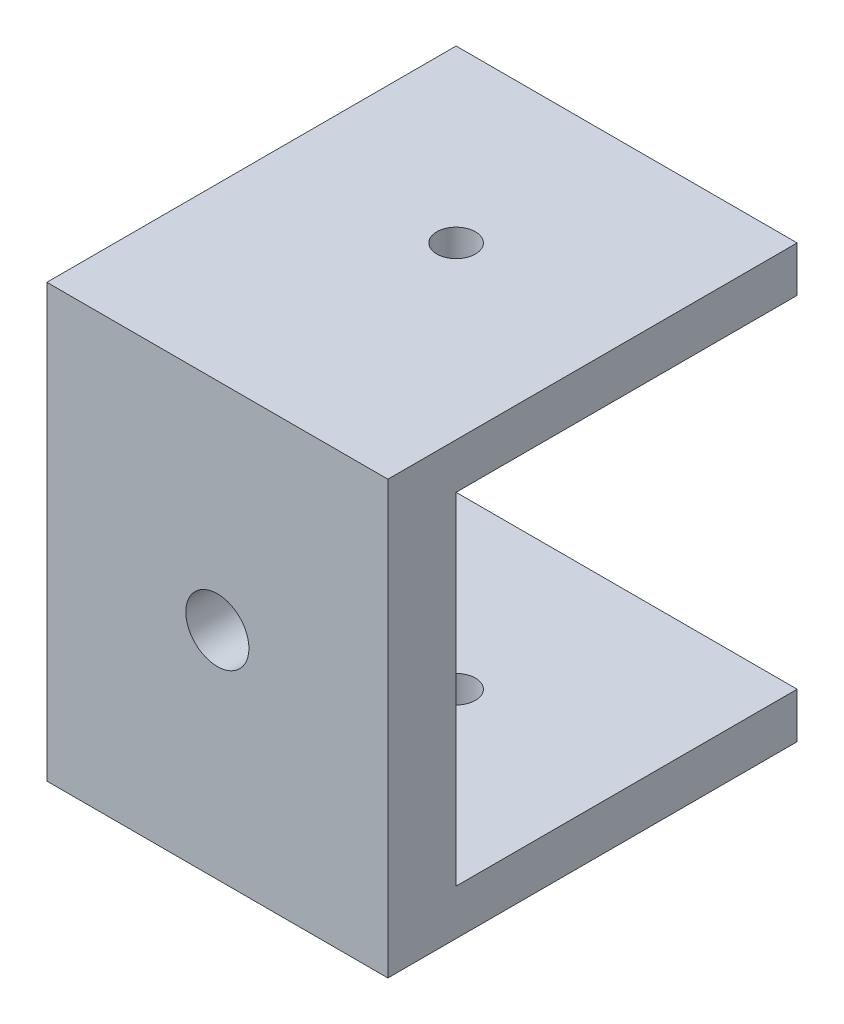
ISO-10303-21;
HEADER;
FILE_DESCRIPTION(('STEP AP214'),'2;1');
FILE_NAME('part.step','',(''),(''),'','','');
FILE_SCHEMA(('AUTOMOTIVE_DESIGN { 1 0 10303 214 1 1 1 1 }'));
ENDSEC;
DATA;
#1=APPLICATION_CONTEXT('core data for automotive mechanical design processes');
#2=APPLICATION_PROTOCOL_DEFINITION('international standard','automotive_design',2000,#1);
#3=PRODUCT_CONTEXT('',#1,'mechanical');
#4=PRODUCT('Part','Part','',(#3));
#5=PRODUCT_RELATED_PRODUCT_CATEGORY('part','',(#4));
#6=PRODUCT_DEFINITION_FORMATION('','',#4);
#7=PRODUCT_DEFINITION_CONTEXT('part definition',#1,'design');
#8=PRODUCT_DEFINITION('design','',#6,#7);
#9=PRODUCT_DEFINITION_SHAPE('','',#8);
#10=(LENGTH_UNIT() NAMED_UNIT(*) SI_UNIT(.MILLI.,.METRE.));
#11=(NAMED_UNIT(*) PLANE_ANGLE_UNIT() SI_UNIT($,.RADIAN.));
#12=(NAMED_UNIT(*) SI_UNIT($,.STERADIAN.) SOLID_ANGLE_UNIT());
#13=UNCERTAINTY_MEASURE_WITH_UNIT(LENGTH_MEASURE(1.E-05),#10,'distance_accuracy_value','');
#14=(GEOMETRIC_REPRESENTATION_CONTEXT(3) GLOBAL_UNCERTAINTY_ASSIGNED_CONTEXT((#13)) GLOBAL_UNIT_ASSIGNED_CONTEXT((#10,
#11,#12)) REPRESENTATION_CONTEXT('',''));
#15=CARTESIAN_POINT('',(0.,0.,0.));
#16=DIRECTION('',(0.,0.,1.));
#17=DIRECTION('',(1.,0.,0.));
#18=AXIS2_PLACEMENT_3D('',#15,#16,#17);
#19=CARTESIAN_POINT('',(30.,0.,-3.));
#20=DIRECTION('',(0.,0.,-1.));
#21=DIRECTION('',(0.,1.,0.));
#22=AXIS2_PLACEMENT_3D('',#19,#20,#21);
#23=PLANE('',#22);
#24=CARTESIAN_POINT('',(15.,0.,-3.));
#25=DIRECTION('',(0.,0.,-1.));
#26=DIRECTION('',(0.,1.,0.));
#27=AXIS2_PLACEMENT_3D('',#24,#25,#26);
#28=CIRCLE('',#27,2.775);
#29=CARTESIAN_POINT('',(15.,2.775,-3.));
#30=VERTEX_POINT('',#29);
#31=EDGE_CURVE('E138',#30,#30,#28,.T.);
#32=ORIENTED_EDGE('',*,*,#31,.F.);
#33=EDGE_LOOP('',(#32));
#34=FACE_BOUND('',#33,.T.);
#35=DIRECTION('',(0.,-1.,0.));
#36=VECTOR('',#35,1.);
#37=CARTESIAN_POINT('',(0.,0.,-3.));
#38=LINE('',#37,#36);
#39=CARTESIAN_POINT('',(0.,15.,-3.));
#40=VERTEX_POINT('',#39);
#41=CARTESIAN_POINT('',(0.,-15.,-3.));
#42=VERTEX_POINT('',#41);
#43=EDGE_CURVE('E135',#40,#42,#38,.T.);
#44=ORIENTED_EDGE('',*,*,#43,.F.);
#45=DIRECTION('',(-1.,0.,0.));
#46=VECTOR('',#45,1.);
#47=CARTESIAN_POINT('',(30.,15.,-3.));
#48=LINE('',#47,#46);
#49=CARTESIAN_POINT('',(30.,15.,-3.));
#50=VERTEX_POINT('',#49);
#51=EDGE_CURVE('E11',#50,#40,#48,.T.);
#52=ORIENTED_EDGE('',*,*,#51,.F.);
#53=DIRECTION('',(0.,-1.,0.));
#54=VECTOR('',#53,1.);
#55=CARTESIAN_POINT('',(30.,0.,-3.));
#56=LINE('',#55,#54);
#57=CARTESIAN_POINT('',(30.,-15.,-3.));
#58=VERTEX_POINT('',#57);
#59=EDGE_CURVE('E154',#50,#58,#56,.T.);
#60=ORIENTED_EDGE('',*,*,#59,.T.);
#61=DIRECTION('',(-1.,0.,0.));
#62=VECTOR('',#61,1.);
#63=CARTESIAN_POINT('',(30.,-15.,-3.));
#64=LINE('',#63,#62);
#65=EDGE_CURVE('E56',#58,#42,#64,.T.);
#66=ORIENTED_EDGE('',*,*,#65,.T.);
#67=EDGE_LOOP('',(#44,#52,#60,#66));
#68=FACE_BOUND('',#67,.T.);
#69=ADVANCED_FACE('F39',(#34,#68),#23,.T.);
#70=CARTESIAN_POINT('',(30.,15.,0.));
#71=DIRECTION('',(0.,1.,0.));
#72=DIRECTION('',(0.,0.,1.));
#73=AXIS2_PLACEMENT_3D('',#70,#71,#72);
#74=PLANE('',#73);
#75=CARTESIAN_POINT('',(15.,15.,-18.));
#76=DIRECTION('',(0.,1.,0.));
#77=DIRECTION('',(0.,0.,1.));
#78=AXIS2_PLACEMENT_3D('',#75,#76,#77);
#79=CIRCLE('',#78,1.7);
#80=CARTESIAN_POINT('',(15.,15.,-16.3));
#81=VERTEX_POINT('',#80);
#82=EDGE_CURVE('E191',#81,#81,#79,.T.);
#83=ORIENTED_EDGE('',*,*,#82,.T.);
#84=EDGE_LOOP('',(#83));
#85=FACE_BOUND('',#84,.T.);
#86=DIRECTION('',(0.,0.,-1.));
#87=VECTOR('',#86,1.);
#88=CARTESIAN_POINT('',(0.,15.,0.));
#89=LINE('',#88,#87);
#90=CARTESIAN_POINT('',(0.,15.,-33.));
#91=VERTEX_POINT('',#90);
#92=EDGE_CURVE('E137',#40,#91,#89,.T.);
#93=ORIENTED_EDGE('',*,*,#92,.T.);
#94=DIRECTION('',(-1.,0.,0.));
#95=VECTOR('',#94,1.);
#96=CARTESIAN_POINT('',(30.,15.,-33.));
#97=LINE('',#96,#95);
#98=CARTESIAN_POINT('',(30.,15.,-33.));
#99=VERTEX_POINT('',#98);
#100=EDGE_CURVE('E48',#99,#91,#97,.T.);
#101=ORIENTED_EDGE('',*,*,#100,.F.);
#102=DIRECTION('',(0.,0.,-1.));
#103=VECTOR('',#102,1.);
#104=CARTESIAN_POINT('',(30.,15.,0.));
#105=LINE('',#104,#103);
#106=EDGE_CURVE('E181',#50,#99,#105,.T.);
#107=ORIENTED_EDGE('',*,*,#106,.F.);
#108=ORIENTED_EDGE('',*,*,#51,.T.);
#109=EDGE_LOOP('',(#93,#101,#107,#108));
#110=FACE_BOUND('',#109,.T.);
#111=ADVANCED_FACE('F211',(#85,#110),#74,.F.);
#112=CARTESIAN_POINT('',(30.,0.,-33.));
#113=DIRECTION('',(0.,0.,1.));
#114=DIRECTION('',(1.,0.,0.));
#115=AXIS2_PLACEMENT_3D('',#112,#113,#114);
#116=PLANE('',#115);
#117=DIRECTION('',(0.,1.,0.));
#118=VECTOR('',#117,1.);
#119=CARTESIAN_POINT('',(0.,0.,-33.));
#120=LINE('',#119,#118);
#121=CARTESIAN_POINT('',(0.,19.,-33.));
#122=VERTEX_POINT('',#121);
#123=EDGE_CURVE('E140',#91,#122,#120,.T.);
#124=ORIENTED_EDGE('',*,*,#123,.T.);
#125=DIRECTION('',(-1.,0.,0.));
#126=VECTOR('',#125,1.);
#127=CARTESIAN_POINT('',(30.,19.,-33.));
#128=LINE('',#127,#126);
#129=CARTESIAN_POINT('',(30.,19.,-33.));
#130=VERTEX_POINT('',#129);
#131=EDGE_CURVE('E160',#130,#122,#128,.T.);
#132=ORIENTED_EDGE('',*,*,#131,.F.);
#133=DIRECTION('',(0.,1.,0.));
#134=VECTOR('',#133,1.);
#135=CARTESIAN_POINT('',(30.,0.,-33.));
#136=LINE('',#135,#134);
#137=EDGE_CURVE('E169',#99,#130,#136,.T.);
#138=ORIENTED_EDGE('',*,*,#137,.F.);
#139=ORIENTED_EDGE('',*,*,#100,.T.);
#140=EDGE_LOOP('',(#124,#132,#138,#139));
#141=FACE_BOUND('',#140,.T.);
#142=ADVANCED_FACE('F167',(#141),#116,.F.);
#143=CARTESIAN_POINT('',(30.,19.,0.));
#144=DIRECTION('',(0.,1.,0.));
#145=DIRECTION('',(0.,0.,1.));
#146=AXIS2_PLACEMENT_3D('',#143,#144,#145);
#147=PLANE('',#146);
#148=CARTESIAN_POINT('',(15.,19.,-18.));
#149=DIRECTION('',(0.,-1.,0.));
#150=DIRECTION('',(0.,0.,-1.));
#151=AXIS2_PLACEMENT_3D('',#148,#149,#150);
#152=CIRCLE('',#151,1.7);
#153=CARTESIAN_POINT('',(15.,19.,-19.7));
#154=VERTEX_POINT('',#153);
#155=EDGE_CURVE('E197',#154,#154,#152,.T.);
#156=ORIENTED_EDGE('',*,*,#155,.T.);
#157=EDGE_LOOP('',(#156));
#158=FACE_BOUND('',#157,.T.);
#159=DIRECTION('',(0.,0.,-1.));
#160=VECTOR('',#159,1.);
#161=CARTESIAN_POINT('',(0.,19.,0.));
#162=LINE('',#161,#160);
#163=CARTESIAN_POINT('',(0.,19.,3.));
#164=VERTEX_POINT('',#163);
#165=EDGE_CURVE('E143',#164,#122,#162,.T.);
#166=ORIENTED_EDGE('',*,*,#165,.F.);
#167=DIRECTION('',(-1.,0.,0.));
#168=VECTOR('',#167,1.);
#169=CARTESIAN_POINT('',(30.,19.,3.));
#170=LINE('',#169,#168);
#171=CARTESIAN_POINT('',(30.,19.,3.));
#172=VERTEX_POINT('',#171);
#173=EDGE_CURVE('E158',#172,#164,#170,.T.);
#174=ORIENTED_EDGE('',*,*,#173,.F.);
#175=DIRECTION('',(0.,0.,-1.));
#176=VECTOR('',#175,1.);
#177=CARTESIAN_POINT('',(30.,19.,0.));
#178=LINE('',#177,#176);
#179=EDGE_CURVE('E179',#172,#130,#178,.T.);
#180=ORIENTED_EDGE('',*,*,#179,.T.);
#181=ORIENTED_EDGE('',*,*,#131,.T.);
#182=EDGE_LOOP('',(#166,#174,#180,#181));
#183=FACE_BOUND('',#182,.T.);
#184=ADVANCED_FACE('F177',(#158,#183),#147,.T.);
#185=CARTESIAN_POINT('',(30.,0.,3.));
#186=DIRECTION('',(0.,0.,-1.));
#187=DIRECTION('',(0.,1.,0.));
#188=AXIS2_PLACEMENT_3D('',#185,#186,#187);
#189=PLANE('',#188);
#190=CARTESIAN_POINT('',(15.,0.,3.));
#191=DIRECTION('',(0.,0.,1.));
#192=DIRECTION('',(1.,0.,0.));
#193=AXIS2_PLACEMENT_3D('',#190,#191,#192);
#194=CIRCLE('',#193,2.775);
#195=CARTESIAN_POINT('',(17.775,0.,3.));
#196=VERTEX_POINT('',#195);
#197=EDGE_CURVE('E188',#196,#196,#194,.T.);
#198=ORIENTED_EDGE('',*,*,#197,.F.);
#199=EDGE_LOOP('',(#198));
#200=FACE_BOUND('',#199,.T.);
#201=DIRECTION('',(0.,-1.,0.));
#202=VECTOR('',#201,1.);
#203=CARTESIAN_POINT('',(0.,0.,3.));
#204=LINE('',#203,#202);
#205=CARTESIAN_POINT('',(0.,-19.,3.));
#206=VERTEX_POINT('',#205);
#207=EDGE_CURVE('E146',#164,#206,#204,.T.);
#208=ORIENTED_EDGE('',*,*,#207,.T.);
#209=DIRECTION('',(-1.,0.,0.));
#210=VECTOR('',#209,1.);
#211=CARTESIAN_POINT('',(30.,-19.,3.));
#212=LINE('',#211,#210);
#213=CARTESIAN_POINT('',(30.,-19.,3.));
#214=VERTEX_POINT('',#213);
#215=EDGE_CURVE('E127',#214,#206,#212,.T.);
#216=ORIENTED_EDGE('',*,*,#215,.F.);
#217=DIRECTION('',(0.,-1.,0.));
#218=VECTOR('',#217,1.);
#219=CARTESIAN_POINT('',(30.,0.,3.));
#220=LINE('',#219,#218);
#221=EDGE_CURVE('E115',#172,#214,#220,.T.);
#222=ORIENTED_EDGE('',*,*,#221,.F.);
#223=ORIENTED_EDGE('',*,*,#173,.T.);
#224=EDGE_LOOP('',(#208,#216,#222,#223));
#225=FACE_BOUND('',#224,.T.);
#226=ADVANCED_FACE('F225',(#200,#225),#189,.F.);
#227=CARTESIAN_POINT('',(30.,-19.,0.));
#228=DIRECTION('',(0.,1.,0.));
#229=DIRECTION('',(0.,0.,1.));
#230=AXIS2_PLACEMENT_3D('',#227,#228,#229);
#231=PLANE('',#230);
#232=CARTESIAN_POINT('',(15.,-19.,-18.));
#233=DIRECTION('',(0.,-1.,0.));
#234=DIRECTION('',(0.,0.,-1.));
#235=AXIS2_PLACEMENT_3D('',#232,#233,#234);
#236=CIRCLE('',#235,1.7);
#237=CARTESIAN_POINT('',(15.,-19.,-19.7));
#238=VERTEX_POINT('',#237);
#239=EDGE_CURVE('E194',#238,#238,#236,.T.);
#240=ORIENTED_EDGE('',*,*,#239,.F.);
#241=EDGE_LOOP('',(#240));
#242=FACE_BOUND('',#241,.T.);
#243=DIRECTION('',(0.,0.,-1.));
#244=VECTOR('',#243,1.);
#245=CARTESIAN_POINT('',(0.,-19.,0.));
#246=LINE('',#245,#244);
#247=CARTESIAN_POINT('',(0.,-19.,-33.));
#248=VERTEX_POINT('',#247);
#249=EDGE_CURVE('E124',#206,#248,#246,.T.);
#250=ORIENTED_EDGE('',*,*,#249,.T.);
#251=DIRECTION('',(-1.,0.,0.));
#252=VECTOR('',#251,1.);
#253=CARTESIAN_POINT('',(30.,-19.,-33.));
#254=LINE('',#253,#252);
#255=CARTESIAN_POINT('',(30.,-19.,-33.));
#256=VERTEX_POINT('',#255);
#257=EDGE_CURVE('E121',#256,#248,#254,.T.);
#258=ORIENTED_EDGE('',*,*,#257,.F.);
#259=DIRECTION('',(0.,0.,-1.));
#260=VECTOR('',#259,1.);
#261=CARTESIAN_POINT('',(30.,-19.,0.));
#262=LINE('',#261,#260);
#263=EDGE_CURVE('E106',#214,#256,#262,.T.);
#264=ORIENTED_EDGE('',*,*,#263,.F.);
#265=ORIENTED_EDGE('',*,*,#215,.T.);
#266=EDGE_LOOP('',(#250,#258,#264,#265));
#267=FACE_BOUND('',#266,.T.);
#268=ADVANCED_FACE('F122',(#242,#267),#231,.F.);
#269=CARTESIAN_POINT('',(30.,0.,-33.));
#270=DIRECTION('',(0.,0.,-1.));
#271=DIRECTION('',(-1.,0.,0.));
#272=AXIS2_PLACEMENT_3D('',#269,#270,#271);
#273=PLANE('',#272);
#274=DIRECTION('',(0.,-1.,0.));
#275=VECTOR('',#274,1.);
#276=CARTESIAN_POINT('',(0.,0.,-33.));
#277=LINE('',#276,#275);
#278=CARTESIAN_POINT('',(0.,-15.,-33.));
#279=VERTEX_POINT('',#278);
#280=EDGE_CURVE('E149',#279,#248,#277,.T.);
#281=ORIENTED_EDGE('',*,*,#280,.F.);
#282=DIRECTION('',(-1.,0.,0.));
#283=VECTOR('',#282,1.);
#284=CARTESIAN_POINT('',(30.,-15.,-33.));
#285=LINE('',#284,#283);
#286=CARTESIAN_POINT('',(30.,-15.,-33.));
#287=VERTEX_POINT('',#286);
#288=EDGE_CURVE('E81',#287,#279,#285,.T.);
#289=ORIENTED_EDGE('',*,*,#288,.F.);
#290=DIRECTION('',(0.,-1.,0.));
#291=VECTOR('',#290,1.);
#292=CARTESIAN_POINT('',(30.,0.,-33.));
#293=LINE('',#292,#291);
#294=EDGE_CURVE('E112',#287,#256,#293,.T.);
#295=ORIENTED_EDGE('',*,*,#294,.T.);
#296=ORIENTED_EDGE('',*,*,#257,.T.);
#297=EDGE_LOOP('',(#281,#289,#295,#296));
#298=FACE_BOUND('',#297,.T.);
#299=ADVANCED_FACE('F129',(#298),#273,.T.);
#300=CARTESIAN_POINT('',(30.,-15.,0.));
#301=DIRECTION('',(0.,1.,0.));
#302=DIRECTION('',(0.,0.,1.));
#303=AXIS2_PLACEMENT_3D('',#300,#301,#302);
#304=PLANE('',#303);
#305=CARTESIAN_POINT('',(15.,-15.,-18.));
#306=DIRECTION('',(0.,1.,0.));
#307=DIRECTION('',(0.,0.,1.));
#308=AXIS2_PLACEMENT_3D('',#305,#306,#307);
#309=CIRCLE('',#308,1.7);
#310=CARTESIAN_POINT('',(15.,-15.,-16.3));
#311=VERTEX_POINT('',#310);
#312=EDGE_CURVE('E42',#311,#311,#309,.T.);
#313=ORIENTED_EDGE('',*,*,#312,.F.);
#314=EDGE_LOOP('',(#313));
#315=FACE_BOUND('',#314,.T.);
#316=DIRECTION('',(0.,0.,-1.));
#317=VECTOR('',#316,1.);
#318=CARTESIAN_POINT('',(0.,-15.,0.));
#319=LINE('',#318,#317);
#320=EDGE_CURVE('E151',#42,#279,#319,.T.);
#321=ORIENTED_EDGE('',*,*,#320,.F.);
#322=ORIENTED_EDGE('',*,*,#65,.F.);
#323=DIRECTION('',(0.,0.,-1.));
#324=VECTOR('',#323,1.);
#325=CARTESIAN_POINT('',(30.,-15.,0.));
#326=LINE('',#325,#324);
#327=EDGE_CURVE('E130',#58,#287,#326,.T.);
#328=ORIENTED_EDGE('',*,*,#327,.T.);
#329=ORIENTED_EDGE('',*,*,#288,.T.);
#330=EDGE_LOOP('',(#321,#322,#328,#329));
#331=FACE_BOUND('',#330,.T.);
#332=ADVANCED_FACE('F207',(#315,#331),#304,.T.);
#333=CARTESIAN_POINT('',(30.,0.,0.));
#334=DIRECTION('',(1.,0.,0.));
#335=DIRECTION('',(0.,0.,-1.));
#336=AXIS2_PLACEMENT_3D('',#333,#334,#335);
#337=PLANE('',#336);
#338=ORIENTED_EDGE('',*,*,#59,.F.);
#339=ORIENTED_EDGE('',*,*,#106,.T.);
#340=ORIENTED_EDGE('',*,*,#137,.T.);
#341=ORIENTED_EDGE('',*,*,#179,.F.);
#342=ORIENTED_EDGE('',*,*,#221,.T.);
#343=ORIENTED_EDGE('',*,*,#263,.T.);
#344=ORIENTED_EDGE('',*,*,#294,.F.);
#345=ORIENTED_EDGE('',*,*,#327,.F.);
#346=EDGE_LOOP('',(#338,#339,#340,#341,#342,#343,#344,#345));
#347=FACE_BOUND('',#346,.T.);
#348=ADVANCED_FACE('F109',(#347),#337,.T.);
#349=CARTESIAN_POINT('',(0.,0.,0.));
#350=DIRECTION('',(1.,0.,0.));
#351=DIRECTION('',(0.,0.,-1.));
#352=AXIS2_PLACEMENT_3D('',#349,#350,#351);
#353=PLANE('',#352);
#354=ORIENTED_EDGE('',*,*,#43,.T.);
#355=ORIENTED_EDGE('',*,*,#320,.T.);
#356=ORIENTED_EDGE('',*,*,#280,.T.);
#357=ORIENTED_EDGE('',*,*,#249,.F.);
#358=ORIENTED_EDGE('',*,*,#207,.F.);
#359=ORIENTED_EDGE('',*,*,#165,.T.);
#360=ORIENTED_EDGE('',*,*,#123,.F.);
#361=ORIENTED_EDGE('',*,*,#92,.F.);
#362=EDGE_LOOP('',(#354,#355,#356,#357,#358,#359,#360,#361));
#363=FACE_BOUND('',#362,.T.);
#364=ADVANCED_FACE('F173',(#363),#353,.F.);
#365=CARTESIAN_POINT('',(15.,0.,-27.));
#366=DIRECTION('',(0.,0.,1.));
#367=DIRECTION('',(1.,0.,0.));
#368=AXIS2_PLACEMENT_3D('',#365,#366,#367);
#369=CYLINDRICAL_SURFACE('',#368,2.775);
#370=ORIENTED_EDGE('',*,*,#31,.T.);
#371=EDGE_LOOP('',(#370));
#372=FACE_BOUND('',#371,.T.);
#373=ORIENTED_EDGE('',*,*,#197,.T.);
#374=EDGE_LOOP('',(#373));
#375=FACE_BOUND('',#374,.T.);
#376=ADVANCED_FACE('F219',(#372,#375),#369,.F.);
#377=CARTESIAN_POINT('',(15.,19.,-18.));
#378=DIRECTION('',(0.,-1.,0.));
#379=DIRECTION('',(0.,0.,-1.));
#380=AXIS2_PLACEMENT_3D('',#377,#378,#379);
#381=CYLINDRICAL_SURFACE('',#380,1.7);
#382=ORIENTED_EDGE('',*,*,#312,.T.);
#383=EDGE_LOOP('',(#382));
#384=FACE_BOUND('',#383,.T.);
#385=ORIENTED_EDGE('',*,*,#239,.T.);
#386=EDGE_LOOP('',(#385));
#387=FACE_BOUND('',#386,.T.);
#388=ADVANCED_FACE('F204',(#384,#387),#381,.F.);
#389=ORIENTED_EDGE('',*,*,#155,.F.);
#390=EDGE_LOOP('',(#389));
#391=FACE_BOUND('',#390,.T.);
#392=ORIENTED_EDGE('',*,*,#82,.F.);
#393=EDGE_LOOP('',(#392));
#394=FACE_BOUND('',#393,.T.);
#395=ADVANCED_FACE('F281',(#391,#394),#381,.F.);
#396=CLOSED_SHELL('',(#69,#111,#142,#184,#226,#268,#299,#332,#348,#364,#376,#388,#395));
#397=MANIFOLD_SOLID_BREP('B2',#396);
#398=ADVANCED_BREP_SHAPE_REPRESENTATION('',(#18,#397),#14);
#399=SHAPE_DEFINITION_REPRESENTATION(#9,#398);
ENDSEC;
END-ISO-10303-21;
